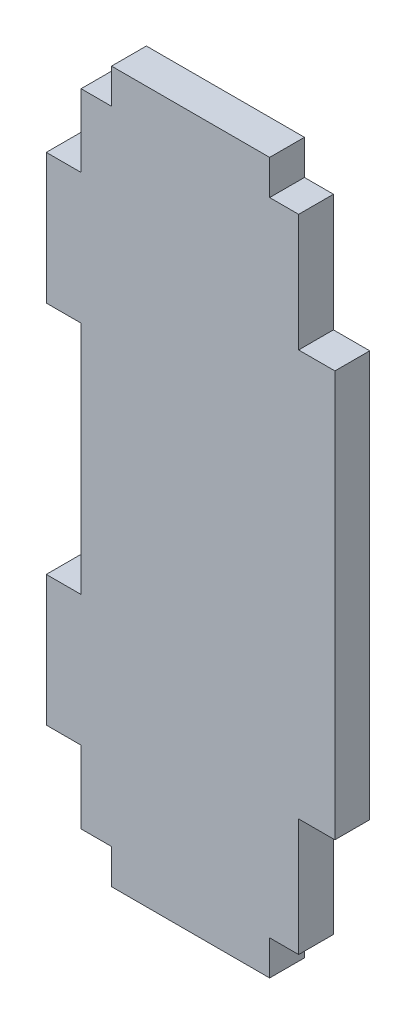
ISO-10303-21;
HEADER;
FILE_DESCRIPTION(('STEP AP214'),'2;1');
FILE_NAME('part.step','',(''),(''),'','','');
FILE_SCHEMA(('AUTOMOTIVE_DESIGN { 1 0 10303 214 1 1 1 1 }'));
ENDSEC;
DATA;
#1=APPLICATION_CONTEXT('core data for automotive mechanical design processes');
#2=APPLICATION_PROTOCOL_DEFINITION('international standard','automotive_design',2000,#1);
#3=PRODUCT_CONTEXT('',#1,'mechanical');
#4=PRODUCT('Part','Part','',(#3));
#5=PRODUCT_RELATED_PRODUCT_CATEGORY('part','',(#4));
#6=PRODUCT_DEFINITION_FORMATION('','',#4);
#7=PRODUCT_DEFINITION_CONTEXT('part definition',#1,'design');
#8=PRODUCT_DEFINITION('design','',#6,#7);
#9=PRODUCT_DEFINITION_SHAPE('','',#8);
#10=(LENGTH_UNIT() NAMED_UNIT(*) SI_UNIT(.MILLI.,.METRE.));
#11=(NAMED_UNIT(*) PLANE_ANGLE_UNIT() SI_UNIT($,.RADIAN.));
#12=(NAMED_UNIT(*) SI_UNIT($,.STERADIAN.) SOLID_ANGLE_UNIT());
#13=UNCERTAINTY_MEASURE_WITH_UNIT(LENGTH_MEASURE(1.E-05),#10,'distance_accuracy_value','');
#14=(GEOMETRIC_REPRESENTATION_CONTEXT(3) GLOBAL_UNCERTAINTY_ASSIGNED_CONTEXT((#13)) GLOBAL_UNIT_ASSIGNED_CONTEXT((#10,
#11,#12)) REPRESENTATION_CONTEXT('',''));
#15=CARTESIAN_POINT('',(0.,0.,0.));
#16=DIRECTION('',(0.,0.,1.));
#17=DIRECTION('',(1.,0.,0.));
#18=AXIS2_PLACEMENT_3D('',#15,#16,#17);
#19=CARTESIAN_POINT('',(0.,-3.04799999999996,3.048));
#20=DIRECTION('',(0.,1.,0.));
#21=DIRECTION('',(-1.,0.,0.));
#22=AXIS2_PLACEMENT_3D('',#19,#20,#21);
#23=PLANE('',#22);
#24=DIRECTION('',(1.,0.,0.));
#25=VECTOR('',#24,1.);
#26=CARTESIAN_POINT('',(0.,-3.04799999999996,0.));
#27=LINE('',#26,#25);
#28=CARTESIAN_POINT('',(-22.225,-3.04800000000001,0.));
#29=VERTEX_POINT('',#28);
#30=CARTESIAN_POINT('',(-19.558,-3.048,0.));
#31=VERTEX_POINT('',#30);
#32=EDGE_CURVE('E225',#29,#31,#27,.T.);
#33=ORIENTED_EDGE('',*,*,#32,.F.);
#34=DIRECTION('',(0.,0.,-1.));
#35=VECTOR('',#34,1.);
#36=CARTESIAN_POINT('',(-22.225,-3.04800000000001,3.048));
#37=LINE('',#36,#35);
#38=CARTESIAN_POINT('',(-22.225,-3.04800000000001,3.048));
#39=VERTEX_POINT('',#38);
#40=EDGE_CURVE('E11',#39,#29,#37,.T.);
#41=ORIENTED_EDGE('',*,*,#40,.F.);
#42=DIRECTION('',(1.,0.,0.));
#43=VECTOR('',#42,1.);
#44=CARTESIAN_POINT('',(0.,-3.04799999999996,3.048));
#45=LINE('',#44,#43);
#46=CARTESIAN_POINT('',(-19.558,-3.048,3.048));
#47=VERTEX_POINT('',#46);
#48=EDGE_CURVE('E291',#39,#47,#45,.T.);
#49=ORIENTED_EDGE('',*,*,#48,.T.);
#50=DIRECTION('',(0.,0.,-1.));
#51=VECTOR('',#50,1.);
#52=CARTESIAN_POINT('',(-19.558,-3.048,3.048));
#53=LINE('',#52,#51);
#54=EDGE_CURVE('E51',#47,#31,#53,.T.);
#55=ORIENTED_EDGE('',*,*,#54,.T.);
#56=EDGE_LOOP('',(#33,#41,#49,#55));
#57=FACE_BOUND('',#56,.T.);
#58=ADVANCED_FACE('F35',(#57),#23,.T.);
#59=CARTESIAN_POINT('',(-22.225,0.,3.048));
#60=DIRECTION('',(-1.,0.,0.));
#61=DIRECTION('',(0.,0.,1.));
#62=AXIS2_PLACEMENT_3D('',#59,#60,#61);
#63=PLANE('',#62);
#64=DIRECTION('',(0.,1.,0.));
#65=VECTOR('',#64,1.);
#66=CARTESIAN_POINT('',(-22.225,0.,0.));
#67=LINE('',#66,#65);
#68=CARTESIAN_POINT('',(-22.225,-9.39800000000001,0.));
#69=VERTEX_POINT('',#68);
#70=EDGE_CURVE('E227',#69,#29,#67,.T.);
#71=ORIENTED_EDGE('',*,*,#70,.F.);
#72=DIRECTION('',(0.,0.,-1.));
#73=VECTOR('',#72,1.);
#74=CARTESIAN_POINT('',(-22.225,-9.39800000000001,3.048));
#75=LINE('',#74,#73);
#76=CARTESIAN_POINT('',(-22.225,-9.39800000000001,3.048));
#77=VERTEX_POINT('',#76);
#78=EDGE_CURVE('E43',#77,#69,#75,.T.);
#79=ORIENTED_EDGE('',*,*,#78,.F.);
#80=DIRECTION('',(0.,1.,0.));
#81=VECTOR('',#80,1.);
#82=CARTESIAN_POINT('',(-22.225,0.,3.048));
#83=LINE('',#82,#81);
#84=EDGE_CURVE('E353',#77,#39,#83,.T.);
#85=ORIENTED_EDGE('',*,*,#84,.T.);
#86=ORIENTED_EDGE('',*,*,#40,.T.);
#87=EDGE_LOOP('',(#71,#79,#85,#86));
#88=FACE_BOUND('',#87,.T.);
#89=ADVANCED_FACE('F341',(#88),#63,.T.);
#90=CARTESIAN_POINT('',(0.,-9.39800000000002,3.048));
#91=DIRECTION('',(0.,1.,0.));
#92=DIRECTION('',(-1.,0.,0.));
#93=AXIS2_PLACEMENT_3D('',#90,#91,#92);
#94=PLANE('',#93);
#95=DIRECTION('',(1.,0.,0.));
#96=VECTOR('',#95,1.);
#97=CARTESIAN_POINT('',(0.,-9.39800000000002,0.));
#98=LINE('',#97,#96);
#99=CARTESIAN_POINT('',(-25.273,-9.398,0.));
#100=VERTEX_POINT('',#99);
#101=EDGE_CURVE('E230',#100,#69,#98,.T.);
#102=ORIENTED_EDGE('',*,*,#101,.F.);
#103=DIRECTION('',(0.,0.,-1.));
#104=VECTOR('',#103,1.);
#105=CARTESIAN_POINT('',(-25.273,-9.398,3.048));
#106=LINE('',#105,#104);
#107=CARTESIAN_POINT('',(-25.273,-9.398,3.048));
#108=VERTEX_POINT('',#107);
#109=EDGE_CURVE('E330',#108,#100,#106,.T.);
#110=ORIENTED_EDGE('',*,*,#109,.F.);
#111=DIRECTION('',(1.,0.,0.));
#112=VECTOR('',#111,1.);
#113=CARTESIAN_POINT('',(0.,-9.39800000000002,3.048));
#114=LINE('',#113,#112);
#115=EDGE_CURVE('E337',#108,#77,#114,.T.);
#116=ORIENTED_EDGE('',*,*,#115,.T.);
#117=ORIENTED_EDGE('',*,*,#78,.T.);
#118=EDGE_LOOP('',(#102,#110,#116,#117));
#119=FACE_BOUND('',#118,.T.);
#120=ADVANCED_FACE('F335',(#119),#94,.T.);
#121=CARTESIAN_POINT('',(-25.273,0.,3.048));
#122=DIRECTION('',(-1.,0.,0.));
#123=DIRECTION('',(0.,0.,1.));
#124=AXIS2_PLACEMENT_3D('',#121,#122,#123);
#125=PLANE('',#124);
#126=DIRECTION('',(0.,1.,0.));
#127=VECTOR('',#126,1.);
#128=CARTESIAN_POINT('',(-25.273,0.,0.));
#129=LINE('',#128,#127);
#130=CARTESIAN_POINT('',(-25.273,-20.828,0.));
#131=VERTEX_POINT('',#130);
#132=EDGE_CURVE('E233',#131,#100,#129,.T.);
#133=ORIENTED_EDGE('',*,*,#132,.F.);
#134=DIRECTION('',(0.,0.,-1.));
#135=VECTOR('',#134,1.);
#136=CARTESIAN_POINT('',(-25.273,-20.828,3.048));
#137=LINE('',#136,#135);
#138=CARTESIAN_POINT('',(-25.273,-20.828,3.048));
#139=VERTEX_POINT('',#138);
#140=EDGE_CURVE('E328',#139,#131,#137,.T.);
#141=ORIENTED_EDGE('',*,*,#140,.F.);
#142=DIRECTION('',(0.,1.,0.));
#143=VECTOR('',#142,1.);
#144=CARTESIAN_POINT('',(-25.273,0.,3.048));
#145=LINE('',#144,#143);
#146=EDGE_CURVE('E350',#139,#108,#145,.T.);
#147=ORIENTED_EDGE('',*,*,#146,.T.);
#148=ORIENTED_EDGE('',*,*,#109,.T.);
#149=EDGE_LOOP('',(#133,#141,#147,#148));
#150=FACE_BOUND('',#149,.T.);
#151=ADVANCED_FACE('F347',(#150),#125,.T.);
#152=CARTESIAN_POINT('',(0.,-20.828,3.048));
#153=DIRECTION('',(0.,-1.,0.));
#154=DIRECTION('',(0.,0.,-1.));
#155=AXIS2_PLACEMENT_3D('',#152,#153,#154);
#156=PLANE('',#155);
#157=DIRECTION('',(-1.,0.,0.));
#158=VECTOR('',#157,1.);
#159=CARTESIAN_POINT('',(0.,-20.828,0.));
#160=LINE('',#159,#158);
#161=CARTESIAN_POINT('',(-22.225,-20.828,0.));
#162=VERTEX_POINT('',#161);
#163=EDGE_CURVE('E236',#162,#131,#160,.T.);
#164=ORIENTED_EDGE('',*,*,#163,.F.);
#165=DIRECTION('',(0.,0.,-1.));
#166=VECTOR('',#165,1.);
#167=CARTESIAN_POINT('',(-22.225,-20.828,3.048));
#168=LINE('',#167,#166);
#169=CARTESIAN_POINT('',(-22.225,-20.828,3.048));
#170=VERTEX_POINT('',#169);
#171=EDGE_CURVE('E326',#170,#162,#168,.T.);
#172=ORIENTED_EDGE('',*,*,#171,.F.);
#173=DIRECTION('',(-1.,0.,0.));
#174=VECTOR('',#173,1.);
#175=CARTESIAN_POINT('',(0.,-20.828,3.048));
#176=LINE('',#175,#174);
#177=EDGE_CURVE('E355',#170,#139,#176,.T.);
#178=ORIENTED_EDGE('',*,*,#177,.T.);
#179=ORIENTED_EDGE('',*,*,#140,.T.);
#180=EDGE_LOOP('',(#164,#172,#178,#179));
#181=FACE_BOUND('',#180,.T.);
#182=ADVANCED_FACE('F607',(#181),#156,.T.);
#183=CARTESIAN_POINT('',(-22.225,0.,3.048));
#184=DIRECTION('',(-1.,0.,0.));
#185=DIRECTION('',(0.,0.,1.));
#186=AXIS2_PLACEMENT_3D('',#183,#184,#185);
#187=PLANE('',#186);
#188=DIRECTION('',(0.,1.,0.));
#189=VECTOR('',#188,1.);
#190=CARTESIAN_POINT('',(-22.225,0.,0.));
#191=LINE('',#190,#189);
#192=CARTESIAN_POINT('',(-22.225,-41.402,0.));
#193=VERTEX_POINT('',#192);
#194=EDGE_CURVE('E239',#193,#162,#191,.T.);
#195=ORIENTED_EDGE('',*,*,#194,.F.);
#196=DIRECTION('',(0.,0.,-1.));
#197=VECTOR('',#196,1.);
#198=CARTESIAN_POINT('',(-22.225,-41.402,3.048));
#199=LINE('',#198,#197);
#200=CARTESIAN_POINT('',(-22.225,-41.402,3.048));
#201=VERTEX_POINT('',#200);
#202=EDGE_CURVE('E324',#201,#193,#199,.T.);
#203=ORIENTED_EDGE('',*,*,#202,.F.);
#204=DIRECTION('',(0.,1.,0.));
#205=VECTOR('',#204,1.);
#206=CARTESIAN_POINT('',(-22.225,0.,3.048));
#207=LINE('',#206,#205);
#208=EDGE_CURVE('E361',#201,#170,#207,.T.);
#209=ORIENTED_EDGE('',*,*,#208,.T.);
#210=ORIENTED_EDGE('',*,*,#171,.T.);
#211=EDGE_LOOP('',(#195,#203,#209,#210));
#212=FACE_BOUND('',#211,.T.);
#213=ADVANCED_FACE('F597',(#212),#187,.T.);
#214=CARTESIAN_POINT('',(0.,-41.402,3.048));
#215=DIRECTION('',(0.,1.,0.));
#216=DIRECTION('',(0.,0.,1.));
#217=AXIS2_PLACEMENT_3D('',#214,#215,#216);
#218=PLANE('',#217);
#219=DIRECTION('',(1.,0.,0.));
#220=VECTOR('',#219,1.);
#221=CARTESIAN_POINT('',(0.,-41.402,0.));
#222=LINE('',#221,#220);
#223=CARTESIAN_POINT('',(-25.273,-41.402,0.));
#224=VERTEX_POINT('',#223);
#225=EDGE_CURVE('E242',#224,#193,#222,.T.);
#226=ORIENTED_EDGE('',*,*,#225,.F.);
#227=DIRECTION('',(0.,0.,-1.));
#228=VECTOR('',#227,1.);
#229=CARTESIAN_POINT('',(-25.273,-41.402,3.048));
#230=LINE('',#229,#228);
#231=CARTESIAN_POINT('',(-25.273,-41.402,3.048));
#232=VERTEX_POINT('',#231);
#233=EDGE_CURVE('E322',#232,#224,#230,.T.);
#234=ORIENTED_EDGE('',*,*,#233,.F.);
#235=DIRECTION('',(1.,0.,0.));
#236=VECTOR('',#235,1.);
#237=CARTESIAN_POINT('',(0.,-41.402,3.048));
#238=LINE('',#237,#236);
#239=EDGE_CURVE('E364',#232,#201,#238,.T.);
#240=ORIENTED_EDGE('',*,*,#239,.T.);
#241=ORIENTED_EDGE('',*,*,#202,.T.);
#242=EDGE_LOOP('',(#226,#234,#240,#241));
#243=FACE_BOUND('',#242,.T.);
#244=ADVANCED_FACE('F587',(#243),#218,.T.);
#245=CARTESIAN_POINT('',(-25.273,0.,3.048));
#246=DIRECTION('',(-1.,0.,0.));
#247=DIRECTION('',(0.,-1.,0.));
#248=AXIS2_PLACEMENT_3D('',#245,#246,#247);
#249=PLANE('',#248);
#250=DIRECTION('',(0.,1.,0.));
#251=VECTOR('',#250,1.);
#252=CARTESIAN_POINT('',(-25.273,0.,0.));
#253=LINE('',#252,#251);
#254=CARTESIAN_POINT('',(-25.273,-52.832,0.));
#255=VERTEX_POINT('',#254);
#256=EDGE_CURVE('E245',#255,#224,#253,.T.);
#257=ORIENTED_EDGE('',*,*,#256,.F.);
#258=DIRECTION('',(0.,0.,-1.));
#259=VECTOR('',#258,1.);
#260=CARTESIAN_POINT('',(-25.273,-52.832,3.048));
#261=LINE('',#260,#259);
#262=CARTESIAN_POINT('',(-25.273,-52.832,3.048));
#263=VERTEX_POINT('',#262);
#264=EDGE_CURVE('E320',#263,#255,#261,.T.);
#265=ORIENTED_EDGE('',*,*,#264,.F.);
#266=DIRECTION('',(0.,1.,0.));
#267=VECTOR('',#266,1.);
#268=CARTESIAN_POINT('',(-25.273,0.,3.048));
#269=LINE('',#268,#267);
#270=EDGE_CURVE('E367',#263,#232,#269,.T.);
#271=ORIENTED_EDGE('',*,*,#270,.T.);
#272=ORIENTED_EDGE('',*,*,#233,.T.);
#273=EDGE_LOOP('',(#257,#265,#271,#272));
#274=FACE_BOUND('',#273,.T.);
#275=ADVANCED_FACE('F577',(#274),#249,.T.);
#276=CARTESIAN_POINT('',(0.,-52.832,3.048));
#277=DIRECTION('',(0.,-1.,0.));
#278=DIRECTION('',(0.,0.,-1.));
#279=AXIS2_PLACEMENT_3D('',#276,#277,#278);
#280=PLANE('',#279);
#281=DIRECTION('',(-1.,0.,0.));
#282=VECTOR('',#281,1.);
#283=CARTESIAN_POINT('',(0.,-52.832,0.));
#284=LINE('',#283,#282);
#285=CARTESIAN_POINT('',(-22.225,-52.832,0.));
#286=VERTEX_POINT('',#285);
#287=EDGE_CURVE('E248',#286,#255,#284,.T.);
#288=ORIENTED_EDGE('',*,*,#287,.F.);
#289=DIRECTION('',(0.,0.,-1.));
#290=VECTOR('',#289,1.);
#291=CARTESIAN_POINT('',(-22.225,-52.832,3.048));
#292=LINE('',#291,#290);
#293=CARTESIAN_POINT('',(-22.225,-52.832,3.048));
#294=VERTEX_POINT('',#293);
#295=EDGE_CURVE('E318',#294,#286,#292,.T.);
#296=ORIENTED_EDGE('',*,*,#295,.F.);
#297=DIRECTION('',(-1.,0.,0.));
#298=VECTOR('',#297,1.);
#299=CARTESIAN_POINT('',(0.,-52.832,3.048));
#300=LINE('',#299,#298);
#301=EDGE_CURVE('E370',#294,#263,#300,.T.);
#302=ORIENTED_EDGE('',*,*,#301,.T.);
#303=ORIENTED_EDGE('',*,*,#264,.T.);
#304=EDGE_LOOP('',(#288,#296,#302,#303));
#305=FACE_BOUND('',#304,.T.);
#306=ADVANCED_FACE('F567',(#305),#280,.T.);
#307=CARTESIAN_POINT('',(-22.225,0.,3.048));
#308=DIRECTION('',(-1.,0.,0.));
#309=DIRECTION('',(0.,0.,1.));
#310=AXIS2_PLACEMENT_3D('',#307,#308,#309);
#311=PLANE('',#310);
#312=DIRECTION('',(0.,1.,0.));
#313=VECTOR('',#312,1.);
#314=CARTESIAN_POINT('',(-22.225,0.,0.));
#315=LINE('',#314,#313);
#316=CARTESIAN_POINT('',(-22.225,-59.182,0.));
#317=VERTEX_POINT('',#316);
#318=EDGE_CURVE('E251',#317,#286,#315,.T.);
#319=ORIENTED_EDGE('',*,*,#318,.F.);
#320=DIRECTION('',(0.,0.,-1.));
#321=VECTOR('',#320,1.);
#322=CARTESIAN_POINT('',(-22.225,-59.182,3.048));
#323=LINE('',#322,#321);
#324=CARTESIAN_POINT('',(-22.225,-59.182,3.048));
#325=VERTEX_POINT('',#324);
#326=EDGE_CURVE('E316',#325,#317,#323,.T.);
#327=ORIENTED_EDGE('',*,*,#326,.F.);
#328=DIRECTION('',(0.,1.,0.));
#329=VECTOR('',#328,1.);
#330=CARTESIAN_POINT('',(-22.225,0.,3.048));
#331=LINE('',#330,#329);
#332=EDGE_CURVE('E373',#325,#294,#331,.T.);
#333=ORIENTED_EDGE('',*,*,#332,.T.);
#334=ORIENTED_EDGE('',*,*,#295,.T.);
#335=EDGE_LOOP('',(#319,#327,#333,#334));
#336=FACE_BOUND('',#335,.T.);
#337=ADVANCED_FACE('F557',(#336),#311,.T.);
#338=CARTESIAN_POINT('',(0.,-59.182,3.048));
#339=DIRECTION('',(0.,-1.,0.));
#340=DIRECTION('',(0.,0.,-1.));
#341=AXIS2_PLACEMENT_3D('',#338,#339,#340);
#342=PLANE('',#341);
#343=DIRECTION('',(-1.,0.,0.));
#344=VECTOR('',#343,1.);
#345=CARTESIAN_POINT('',(0.,-59.182,0.));
#346=LINE('',#345,#344);
#347=CARTESIAN_POINT('',(-19.558,-59.182,0.));
#348=VERTEX_POINT('',#347);
#349=EDGE_CURVE('E254',#348,#317,#346,.T.);
#350=ORIENTED_EDGE('',*,*,#349,.F.);
#351=DIRECTION('',(0.,0.,-1.));
#352=VECTOR('',#351,1.);
#353=CARTESIAN_POINT('',(-19.558,-59.182,3.048));
#354=LINE('',#353,#352);
#355=CARTESIAN_POINT('',(-19.558,-59.182,3.048));
#356=VERTEX_POINT('',#355);
#357=EDGE_CURVE('E314',#356,#348,#354,.T.);
#358=ORIENTED_EDGE('',*,*,#357,.F.);
#359=DIRECTION('',(-1.,0.,0.));
#360=VECTOR('',#359,1.);
#361=CARTESIAN_POINT('',(0.,-59.182,3.048));
#362=LINE('',#361,#360);
#363=EDGE_CURVE('E376',#356,#325,#362,.T.);
#364=ORIENTED_EDGE('',*,*,#363,.T.);
#365=ORIENTED_EDGE('',*,*,#326,.T.);
#366=EDGE_LOOP('',(#350,#358,#364,#365));
#367=FACE_BOUND('',#366,.T.);
#368=ADVANCED_FACE('F547',(#367),#342,.T.);
#369=CARTESIAN_POINT('',(-19.558,0.,3.048));
#370=DIRECTION('',(1.,0.,0.));
#371=DIRECTION('',(0.,0.,-1.));
#372=AXIS2_PLACEMENT_3D('',#369,#370,#371);
#373=PLANE('',#372);
#374=DIRECTION('',(0.,-1.,0.));
#375=VECTOR('',#374,1.);
#376=CARTESIAN_POINT('',(-19.558,0.,0.));
#377=LINE('',#376,#375);
#378=CARTESIAN_POINT('',(-19.558,-62.23,0.));
#379=VERTEX_POINT('',#378);
#380=EDGE_CURVE('E257',#348,#379,#377,.T.);
#381=ORIENTED_EDGE('',*,*,#380,.T.);
#382=DIRECTION('',(0.,0.,-1.));
#383=VECTOR('',#382,1.);
#384=CARTESIAN_POINT('',(-19.558,-62.23,3.048));
#385=LINE('',#384,#383);
#386=CARTESIAN_POINT('',(-19.558,-62.23,3.048));
#387=VERTEX_POINT('',#386);
#388=EDGE_CURVE('E311',#387,#379,#385,.T.);
#389=ORIENTED_EDGE('',*,*,#388,.F.);
#390=DIRECTION('',(0.,-1.,0.));
#391=VECTOR('',#390,1.);
#392=CARTESIAN_POINT('',(-19.558,0.,3.048));
#393=LINE('',#392,#391);
#394=EDGE_CURVE('E379',#356,#387,#393,.T.);
#395=ORIENTED_EDGE('',*,*,#394,.F.);
#396=ORIENTED_EDGE('',*,*,#357,.T.);
#397=EDGE_LOOP('',(#381,#389,#395,#396));
#398=FACE_BOUND('',#397,.T.);
#399=ADVANCED_FACE('F537',(#398),#373,.F.);
#400=CARTESIAN_POINT('',(0.,-62.23,3.048));
#401=DIRECTION('',(0.,1.,0.));
#402=DIRECTION('',(0.,0.,1.));
#403=AXIS2_PLACEMENT_3D('',#400,#401,#402);
#404=PLANE('',#403);
#405=DIRECTION('',(1.,0.,0.));
#406=VECTOR('',#405,1.);
#407=CARTESIAN_POINT('',(0.,-62.23,0.));
#408=LINE('',#407,#406);
#409=CARTESIAN_POINT('',(-5.715,-62.23,0.));
#410=VERTEX_POINT('',#409);
#411=EDGE_CURVE('E259',#379,#410,#408,.T.);
#412=ORIENTED_EDGE('',*,*,#411,.T.);
#413=DIRECTION('',(0.,0.,-1.));
#414=VECTOR('',#413,1.);
#415=CARTESIAN_POINT('',(-5.715,-62.23,3.048));
#416=LINE('',#415,#414);
#417=CARTESIAN_POINT('',(-5.715,-62.23,3.048));
#418=VERTEX_POINT('',#417);
#419=EDGE_CURVE('E309',#418,#410,#416,.T.);
#420=ORIENTED_EDGE('',*,*,#419,.F.);
#421=DIRECTION('',(1.,0.,0.));
#422=VECTOR('',#421,1.);
#423=CARTESIAN_POINT('',(0.,-62.23,3.048));
#424=LINE('',#423,#422);
#425=EDGE_CURVE('E381',#387,#418,#424,.T.);
#426=ORIENTED_EDGE('',*,*,#425,.F.);
#427=ORIENTED_EDGE('',*,*,#388,.T.);
#428=EDGE_LOOP('',(#412,#420,#426,#427));
#429=FACE_BOUND('',#428,.T.);
#430=ADVANCED_FACE('F527',(#429),#404,.F.);
#431=CARTESIAN_POINT('',(-5.715,0.,3.048));
#432=DIRECTION('',(1.,0.,0.));
#433=DIRECTION('',(0.,0.,-1.));
#434=AXIS2_PLACEMENT_3D('',#431,#432,#433);
#435=PLANE('',#434);
#436=DIRECTION('',(0.,-1.,0.));
#437=VECTOR('',#436,1.);
#438=CARTESIAN_POINT('',(-5.715,0.,0.));
#439=LINE('',#438,#437);
#440=CARTESIAN_POINT('',(-5.715,-59.182,0.));
#441=VERTEX_POINT('',#440);
#442=EDGE_CURVE('E262',#441,#410,#439,.T.);
#443=ORIENTED_EDGE('',*,*,#442,.F.);
#444=DIRECTION('',(0.,0.,-1.));
#445=VECTOR('',#444,1.);
#446=CARTESIAN_POINT('',(-5.715,-59.182,3.048));
#447=LINE('',#446,#445);
#448=CARTESIAN_POINT('',(-5.715,-59.182,3.048));
#449=VERTEX_POINT('',#448);
#450=EDGE_CURVE('E307',#449,#441,#447,.T.);
#451=ORIENTED_EDGE('',*,*,#450,.F.);
#452=DIRECTION('',(0.,-1.,0.));
#453=VECTOR('',#452,1.);
#454=CARTESIAN_POINT('',(-5.715,0.,3.048));
#455=LINE('',#454,#453);
#456=EDGE_CURVE('E383',#449,#418,#455,.T.);
#457=ORIENTED_EDGE('',*,*,#456,.T.);
#458=ORIENTED_EDGE('',*,*,#419,.T.);
#459=EDGE_LOOP('',(#443,#451,#457,#458));
#460=FACE_BOUND('',#459,.T.);
#461=ADVANCED_FACE('F517',(#460),#435,.T.);
#462=CARTESIAN_POINT('',(0.,-59.182,3.048));
#463=DIRECTION('',(0.,1.,0.));
#464=DIRECTION('',(0.,0.,1.));
#465=AXIS2_PLACEMENT_3D('',#462,#463,#464);
#466=PLANE('',#465);
#467=DIRECTION('',(1.,0.,0.));
#468=VECTOR('',#467,1.);
#469=CARTESIAN_POINT('',(0.,-59.182,0.));
#470=LINE('',#469,#468);
#471=CARTESIAN_POINT('',(-3.175,-59.182,0.));
#472=VERTEX_POINT('',#471);
#473=EDGE_CURVE('E265',#441,#472,#470,.T.);
#474=ORIENTED_EDGE('',*,*,#473,.T.);
#475=DIRECTION('',(0.,0.,-1.));
#476=VECTOR('',#475,1.);
#477=CARTESIAN_POINT('',(-3.175,-59.182,3.048));
#478=LINE('',#477,#476);
#479=CARTESIAN_POINT('',(-3.175,-59.182,3.048));
#480=VERTEX_POINT('',#479);
#481=EDGE_CURVE('E305',#480,#472,#478,.T.);
#482=ORIENTED_EDGE('',*,*,#481,.F.);
#483=DIRECTION('',(1.,0.,0.));
#484=VECTOR('',#483,1.);
#485=CARTESIAN_POINT('',(0.,-59.182,3.048));
#486=LINE('',#485,#484);
#487=EDGE_CURVE('E386',#449,#480,#486,.T.);
#488=ORIENTED_EDGE('',*,*,#487,.F.);
#489=ORIENTED_EDGE('',*,*,#450,.T.);
#490=EDGE_LOOP('',(#474,#482,#488,#489));
#491=FACE_BOUND('',#490,.T.);
#492=ADVANCED_FACE('F506',(#491),#466,.F.);
#493=CARTESIAN_POINT('',(-3.175,0.,3.048));
#494=DIRECTION('',(1.,0.,0.));
#495=DIRECTION('',(0.,0.,-1.));
#496=AXIS2_PLACEMENT_3D('',#493,#494,#495);
#497=PLANE('',#496);
#498=DIRECTION('',(0.,-1.,0.));
#499=VECTOR('',#498,1.);
#500=CARTESIAN_POINT('',(-3.175,0.,0.));
#501=LINE('',#500,#499);
#502=CARTESIAN_POINT('',(-3.175,-48.895,0.));
#503=VERTEX_POINT('',#502);
#504=EDGE_CURVE('E268',#503,#472,#501,.T.);
#505=ORIENTED_EDGE('',*,*,#504,.F.);
#506=DIRECTION('',(0.,0.,-1.));
#507=VECTOR('',#506,1.);
#508=CARTESIAN_POINT('',(-3.175,-48.895,3.048));
#509=LINE('',#508,#507);
#510=CARTESIAN_POINT('',(-3.175,-48.895,3.048));
#511=VERTEX_POINT('',#510);
#512=EDGE_CURVE('E303',#511,#503,#509,.T.);
#513=ORIENTED_EDGE('',*,*,#512,.F.);
#514=DIRECTION('',(0.,-1.,0.));
#515=VECTOR('',#514,1.);
#516=CARTESIAN_POINT('',(-3.175,0.,3.048));
#517=LINE('',#516,#515);
#518=EDGE_CURVE('E388',#511,#480,#517,.T.);
#519=ORIENTED_EDGE('',*,*,#518,.T.);
#520=ORIENTED_EDGE('',*,*,#481,.T.);
#521=EDGE_LOOP('',(#505,#513,#519,#520));
#522=FACE_BOUND('',#521,.T.);
#523=ADVANCED_FACE('F496',(#522),#497,.T.);
#524=CARTESIAN_POINT('',(0.,-48.895,3.048));
#525=DIRECTION('',(0.,1.,0.));
#526=DIRECTION('',(0.,0.,1.));
#527=AXIS2_PLACEMENT_3D('',#524,#525,#526);
#528=PLANE('',#527);
#529=DIRECTION('',(1.,0.,0.));
#530=VECTOR('',#529,1.);
#531=CARTESIAN_POINT('',(0.,-48.895,0.));
#532=LINE('',#531,#530);
#533=CARTESIAN_POINT('',(0.,-48.895,0.));
#534=VERTEX_POINT('',#533);
#535=EDGE_CURVE('E271',#503,#534,#532,.T.);
#536=ORIENTED_EDGE('',*,*,#535,.T.);
#537=DIRECTION('',(0.,0.,-1.));
#538=VECTOR('',#537,1.);
#539=CARTESIAN_POINT('',(0.,-48.895,3.048));
#540=LINE('',#539,#538);
#541=CARTESIAN_POINT('',(0.,-48.895,3.048));
#542=VERTEX_POINT('',#541);
#543=EDGE_CURVE('E301',#542,#534,#540,.T.);
#544=ORIENTED_EDGE('',*,*,#543,.F.);
#545=DIRECTION('',(1.,0.,0.));
#546=VECTOR('',#545,1.);
#547=CARTESIAN_POINT('',(0.,-48.895,3.048));
#548=LINE('',#547,#546);
#549=EDGE_CURVE('E391',#511,#542,#548,.T.);
#550=ORIENTED_EDGE('',*,*,#549,.F.);
#551=ORIENTED_EDGE('',*,*,#512,.T.);
#552=EDGE_LOOP('',(#536,#544,#550,#551));
#553=FACE_BOUND('',#552,.T.);
#554=ADVANCED_FACE('F486',(#553),#528,.F.);
#555=CARTESIAN_POINT('',(0.,0.,3.048));
#556=DIRECTION('',(1.,0.,0.));
#557=DIRECTION('',(0.,0.,-1.));
#558=AXIS2_PLACEMENT_3D('',#555,#556,#557);
#559=PLANE('',#558);
#560=DIRECTION('',(0.,-1.,0.));
#561=VECTOR('',#560,1.);
#562=CARTESIAN_POINT('',(0.,0.,0.));
#563=LINE('',#562,#561);
#564=CARTESIAN_POINT('',(0.,-13.335,0.));
#565=VERTEX_POINT('',#564);
#566=EDGE_CURVE('E274',#565,#534,#563,.T.);
#567=ORIENTED_EDGE('',*,*,#566,.F.);
#568=DIRECTION('',(0.,0.,-1.));
#569=VECTOR('',#568,1.);
#570=CARTESIAN_POINT('',(0.,-13.335,3.048));
#571=LINE('',#570,#569);
#572=CARTESIAN_POINT('',(0.,-13.335,3.048));
#573=VERTEX_POINT('',#572);
#574=EDGE_CURVE('E299',#573,#565,#571,.T.);
#575=ORIENTED_EDGE('',*,*,#574,.F.);
#576=DIRECTION('',(0.,-1.,0.));
#577=VECTOR('',#576,1.);
#578=CARTESIAN_POINT('',(0.,0.,3.048));
#579=LINE('',#578,#577);
#580=EDGE_CURVE('E393',#573,#542,#579,.T.);
#581=ORIENTED_EDGE('',*,*,#580,.T.);
#582=ORIENTED_EDGE('',*,*,#543,.T.);
#583=EDGE_LOOP('',(#567,#575,#581,#582));
#584=FACE_BOUND('',#583,.T.);
#585=ADVANCED_FACE('F477',(#584),#559,.T.);
#586=CARTESIAN_POINT('',(0.,-13.335,3.048));
#587=DIRECTION('',(0.,1.,0.));
#588=DIRECTION('',(0.,0.,1.));
#589=AXIS2_PLACEMENT_3D('',#586,#587,#588);
#590=PLANE('',#589);
#591=DIRECTION('',(1.,0.,0.));
#592=VECTOR('',#591,1.);
#593=CARTESIAN_POINT('',(0.,-13.335,0.));
#594=LINE('',#593,#592);
#595=CARTESIAN_POINT('',(-3.175,-13.335,0.));
#596=VERTEX_POINT('',#595);
#597=EDGE_CURVE('E277',#596,#565,#594,.T.);
#598=ORIENTED_EDGE('',*,*,#597,.F.);
#599=DIRECTION('',(0.,0.,-1.));
#600=VECTOR('',#599,1.);
#601=CARTESIAN_POINT('',(-3.175,-13.335,3.048));
#602=LINE('',#601,#600);
#603=CARTESIAN_POINT('',(-3.175,-13.335,3.048));
#604=VERTEX_POINT('',#603);
#605=EDGE_CURVE('E297',#604,#596,#602,.T.);
#606=ORIENTED_EDGE('',*,*,#605,.F.);
#607=DIRECTION('',(1.,0.,0.));
#608=VECTOR('',#607,1.);
#609=CARTESIAN_POINT('',(0.,-13.335,3.048));
#610=LINE('',#609,#608);
#611=EDGE_CURVE('E396',#604,#573,#610,.T.);
#612=ORIENTED_EDGE('',*,*,#611,.T.);
#613=ORIENTED_EDGE('',*,*,#574,.T.);
#614=EDGE_LOOP('',(#598,#606,#612,#613));
#615=FACE_BOUND('',#614,.T.);
#616=ADVANCED_FACE('F408',(#615),#590,.T.);
#617=CARTESIAN_POINT('',(-3.175,0.,3.048));
#618=DIRECTION('',(1.,0.,0.));
#619=DIRECTION('',(0.,1.,0.));
#620=AXIS2_PLACEMENT_3D('',#617,#618,#619);
#621=PLANE('',#620);
#622=DIRECTION('',(0.,-1.,0.));
#623=VECTOR('',#622,1.);
#624=CARTESIAN_POINT('',(-3.175,0.,0.));
#625=LINE('',#624,#623);
#626=CARTESIAN_POINT('',(-3.175,-3.048,0.));
#627=VERTEX_POINT('',#626);
#628=EDGE_CURVE('E280',#627,#596,#625,.T.);
#629=ORIENTED_EDGE('',*,*,#628,.F.);
#630=DIRECTION('',(0.,0.,-1.));
#631=VECTOR('',#630,1.);
#632=CARTESIAN_POINT('',(-3.175,-3.048,3.048));
#633=LINE('',#632,#631);
#634=CARTESIAN_POINT('',(-3.175,-3.048,3.048));
#635=VERTEX_POINT('',#634);
#636=EDGE_CURVE('E295',#635,#627,#633,.T.);
#637=ORIENTED_EDGE('',*,*,#636,.F.);
#638=DIRECTION('',(0.,-1.,0.));
#639=VECTOR('',#638,1.);
#640=CARTESIAN_POINT('',(-3.175,0.,3.048));
#641=LINE('',#640,#639);
#642=EDGE_CURVE('E399',#635,#604,#641,.T.);
#643=ORIENTED_EDGE('',*,*,#642,.T.);
#644=ORIENTED_EDGE('',*,*,#605,.T.);
#645=EDGE_LOOP('',(#629,#637,#643,#644));
#646=FACE_BOUND('',#645,.T.);
#647=ADVANCED_FACE('F403',(#646),#621,.T.);
#648=CARTESIAN_POINT('',(0.,-3.048,3.048));
#649=DIRECTION('',(0.,-1.,0.));
#650=DIRECTION('',(0.,0.,-1.));
#651=AXIS2_PLACEMENT_3D('',#648,#649,#650);
#652=PLANE('',#651);
#653=DIRECTION('',(-1.,0.,0.));
#654=VECTOR('',#653,1.);
#655=CARTESIAN_POINT('',(0.,-3.048,0.));
#656=LINE('',#655,#654);
#657=CARTESIAN_POINT('',(-5.715,-3.048,0.));
#658=VERTEX_POINT('',#657);
#659=EDGE_CURVE('E283',#627,#658,#656,.T.);
#660=ORIENTED_EDGE('',*,*,#659,.T.);
#661=DIRECTION('',(0.,0.,-1.));
#662=VECTOR('',#661,1.);
#663=CARTESIAN_POINT('',(-5.715,-3.048,3.048));
#664=LINE('',#663,#662);
#665=CARTESIAN_POINT('',(-5.715,-3.048,3.048));
#666=VERTEX_POINT('',#665);
#667=EDGE_CURVE('E217',#666,#658,#664,.T.);
#668=ORIENTED_EDGE('',*,*,#667,.F.);
#669=DIRECTION('',(-1.,0.,0.));
#670=VECTOR('',#669,1.);
#671=CARTESIAN_POINT('',(0.,-3.048,3.048));
#672=LINE('',#671,#670);
#673=EDGE_CURVE('E205',#635,#666,#672,.T.);
#674=ORIENTED_EDGE('',*,*,#673,.F.);
#675=ORIENTED_EDGE('',*,*,#636,.T.);
#676=EDGE_LOOP('',(#660,#668,#674,#675));
#677=FACE_BOUND('',#676,.T.);
#678=ADVANCED_FACE('F412',(#677),#652,.F.);
#679=CARTESIAN_POINT('',(-5.715,0.,3.048));
#680=DIRECTION('',(-1.,0.,0.));
#681=DIRECTION('',(0.,0.,1.));
#682=AXIS2_PLACEMENT_3D('',#679,#680,#681);
#683=PLANE('',#682);
#684=DIRECTION('',(0.,1.,0.));
#685=VECTOR('',#684,1.);
#686=CARTESIAN_POINT('',(-5.715,0.,0.));
#687=LINE('',#686,#685);
#688=CARTESIAN_POINT('',(-5.715,0.,0.));
#689=VERTEX_POINT('',#688);
#690=EDGE_CURVE('E214',#658,#689,#687,.T.);
#691=ORIENTED_EDGE('',*,*,#690,.T.);
#692=DIRECTION('',(0.,0.,-1.));
#693=VECTOR('',#692,1.);
#694=CARTESIAN_POINT('',(-5.715,0.,3.048));
#695=LINE('',#694,#693);
#696=CARTESIAN_POINT('',(-5.715,0.,3.048));
#697=VERTEX_POINT('',#696);
#698=EDGE_CURVE('E211',#697,#689,#695,.T.);
#699=ORIENTED_EDGE('',*,*,#698,.F.);
#700=DIRECTION('',(0.,1.,0.));
#701=VECTOR('',#700,1.);
#702=CARTESIAN_POINT('',(-5.715,0.,3.048));
#703=LINE('',#702,#701);
#704=EDGE_CURVE('E197',#666,#697,#703,.T.);
#705=ORIENTED_EDGE('',*,*,#704,.F.);
#706=ORIENTED_EDGE('',*,*,#667,.T.);
#707=EDGE_LOOP('',(#691,#699,#705,#706));
#708=FACE_BOUND('',#707,.T.);
#709=ADVANCED_FACE('F212',(#708),#683,.F.);
#710=CARTESIAN_POINT('',(0.,0.,3.048));
#711=DIRECTION('',(0.,-1.,0.));
#712=DIRECTION('',(1.,0.,0.));
#713=AXIS2_PLACEMENT_3D('',#710,#711,#712);
#714=PLANE('',#713);
#715=DIRECTION('',(-1.,0.,0.));
#716=VECTOR('',#715,1.);
#717=CARTESIAN_POINT('',(0.,0.,0.));
#718=LINE('',#717,#716);
#719=CARTESIAN_POINT('',(-19.558,0.,0.));
#720=VERTEX_POINT('',#719);
#721=EDGE_CURVE('E286',#689,#720,#718,.T.);
#722=ORIENTED_EDGE('',*,*,#721,.T.);
#723=DIRECTION('',(0.,0.,-1.));
#724=VECTOR('',#723,1.);
#725=CARTESIAN_POINT('',(-19.558,0.,3.048));
#726=LINE('',#725,#724);
#727=CARTESIAN_POINT('',(-19.558,0.,3.048));
#728=VERTEX_POINT('',#727);
#729=EDGE_CURVE('E125',#728,#720,#726,.T.);
#730=ORIENTED_EDGE('',*,*,#729,.F.);
#731=DIRECTION('',(-1.,0.,0.));
#732=VECTOR('',#731,1.);
#733=CARTESIAN_POINT('',(0.,0.,3.048));
#734=LINE('',#733,#732);
#735=EDGE_CURVE('E202',#697,#728,#734,.T.);
#736=ORIENTED_EDGE('',*,*,#735,.F.);
#737=ORIENTED_EDGE('',*,*,#698,.T.);
#738=EDGE_LOOP('',(#722,#730,#736,#737));
#739=FACE_BOUND('',#738,.T.);
#740=ADVANCED_FACE('F219',(#739),#714,.F.);
#741=CARTESIAN_POINT('',(-19.558,0.,3.048));
#742=DIRECTION('',(-1.,0.,0.));
#743=DIRECTION('',(0.,0.,1.));
#744=AXIS2_PLACEMENT_3D('',#741,#742,#743);
#745=PLANE('',#744);
#746=DIRECTION('',(0.,1.,0.));
#747=VECTOR('',#746,1.);
#748=CARTESIAN_POINT('',(-19.558,0.,0.));
#749=LINE('',#748,#747);
#750=EDGE_CURVE('E288',#31,#720,#749,.T.);
#751=ORIENTED_EDGE('',*,*,#750,.F.);
#752=ORIENTED_EDGE('',*,*,#54,.F.);
#753=DIRECTION('',(0.,1.,0.));
#754=VECTOR('',#753,1.);
#755=CARTESIAN_POINT('',(-19.558,0.,3.048));
#756=LINE('',#755,#754);
#757=EDGE_CURVE('E220',#47,#728,#756,.T.);
#758=ORIENTED_EDGE('',*,*,#757,.T.);
#759=ORIENTED_EDGE('',*,*,#729,.T.);
#760=EDGE_LOOP('',(#751,#752,#758,#759));
#761=FACE_BOUND('',#760,.T.);
#762=ADVANCED_FACE('F425',(#761),#745,.T.);
#763=CARTESIAN_POINT('',(0.,0.,3.048));
#764=DIRECTION('',(0.,0.,1.));
#765=DIRECTION('',(1.,0.,0.));
#766=AXIS2_PLACEMENT_3D('',#763,#764,#765);
#767=PLANE('',#766);
#768=ORIENTED_EDGE('',*,*,#48,.F.);
#769=ORIENTED_EDGE('',*,*,#84,.F.);
#770=ORIENTED_EDGE('',*,*,#115,.F.);
#771=ORIENTED_EDGE('',*,*,#146,.F.);
#772=ORIENTED_EDGE('',*,*,#177,.F.);
#773=ORIENTED_EDGE('',*,*,#208,.F.);
#774=ORIENTED_EDGE('',*,*,#239,.F.);
#775=ORIENTED_EDGE('',*,*,#270,.F.);
#776=ORIENTED_EDGE('',*,*,#301,.F.);
#777=ORIENTED_EDGE('',*,*,#332,.F.);
#778=ORIENTED_EDGE('',*,*,#363,.F.);
#779=ORIENTED_EDGE('',*,*,#394,.T.);
#780=ORIENTED_EDGE('',*,*,#425,.T.);
#781=ORIENTED_EDGE('',*,*,#456,.F.);
#782=ORIENTED_EDGE('',*,*,#487,.T.);
#783=ORIENTED_EDGE('',*,*,#518,.F.);
#784=ORIENTED_EDGE('',*,*,#549,.T.);
#785=ORIENTED_EDGE('',*,*,#580,.F.);
#786=ORIENTED_EDGE('',*,*,#611,.F.);
#787=ORIENTED_EDGE('',*,*,#642,.F.);
#788=ORIENTED_EDGE('',*,*,#673,.T.);
#789=ORIENTED_EDGE('',*,*,#704,.T.);
#790=ORIENTED_EDGE('',*,*,#735,.T.);
#791=ORIENTED_EDGE('',*,*,#757,.F.);
#792=EDGE_LOOP('',(#768,#769,#770,#771,#772,#773,#774,#775,#776,#777,#778,#779,#780,#781,#782,
#783,#784,#785,#786,#787,#788,#789,#790,#791));
#793=FACE_BOUND('',#792,.T.);
#794=ADVANCED_FACE('F199',(#793),#767,.T.);
#795=CARTESIAN_POINT('',(0.,0.,0.));
#796=DIRECTION('',(0.,0.,1.));
#797=DIRECTION('',(1.,0.,0.));
#798=AXIS2_PLACEMENT_3D('',#795,#796,#797);
#799=PLANE('',#798);
#800=ORIENTED_EDGE('',*,*,#32,.T.);
#801=ORIENTED_EDGE('',*,*,#750,.T.);
#802=ORIENTED_EDGE('',*,*,#721,.F.);
#803=ORIENTED_EDGE('',*,*,#690,.F.);
#804=ORIENTED_EDGE('',*,*,#659,.F.);
#805=ORIENTED_EDGE('',*,*,#628,.T.);
#806=ORIENTED_EDGE('',*,*,#597,.T.);
#807=ORIENTED_EDGE('',*,*,#566,.T.);
#808=ORIENTED_EDGE('',*,*,#535,.F.);
#809=ORIENTED_EDGE('',*,*,#504,.T.);
#810=ORIENTED_EDGE('',*,*,#473,.F.);
#811=ORIENTED_EDGE('',*,*,#442,.T.);
#812=ORIENTED_EDGE('',*,*,#411,.F.);
#813=ORIENTED_EDGE('',*,*,#380,.F.);
#814=ORIENTED_EDGE('',*,*,#349,.T.);
#815=ORIENTED_EDGE('',*,*,#318,.T.);
#816=ORIENTED_EDGE('',*,*,#287,.T.);
#817=ORIENTED_EDGE('',*,*,#256,.T.);
#818=ORIENTED_EDGE('',*,*,#225,.T.);
#819=ORIENTED_EDGE('',*,*,#194,.T.);
#820=ORIENTED_EDGE('',*,*,#163,.T.);
#821=ORIENTED_EDGE('',*,*,#132,.T.);
#822=ORIENTED_EDGE('',*,*,#101,.T.);
#823=ORIENTED_EDGE('',*,*,#70,.T.);
#824=EDGE_LOOP('',(#800,#801,#802,#803,#804,#805,#806,#807,#808,#809,#810,#811,#812,#813,#814,
#815,#816,#817,#818,#819,#820,#821,#822,#823));
#825=FACE_BOUND('',#824,.T.);
#826=ADVANCED_FACE('F343',(#825),#799,.F.);
#827=CLOSED_SHELL('',(#58,#89,#120,#151,#182,#213,#244,#275,#306,#337,#368,#399,#430,#461,#492,
#523,#554,#585,#616,#647,#678,#709,#740,#762,#794,#826));
#828=MANIFOLD_SOLID_BREP('B2',#827);
#829=ADVANCED_BREP_SHAPE_REPRESENTATION('',(#18,#828),#14);
#830=SHAPE_DEFINITION_REPRESENTATION(#9,#829);
ENDSEC;
END-ISO-10303-21;
